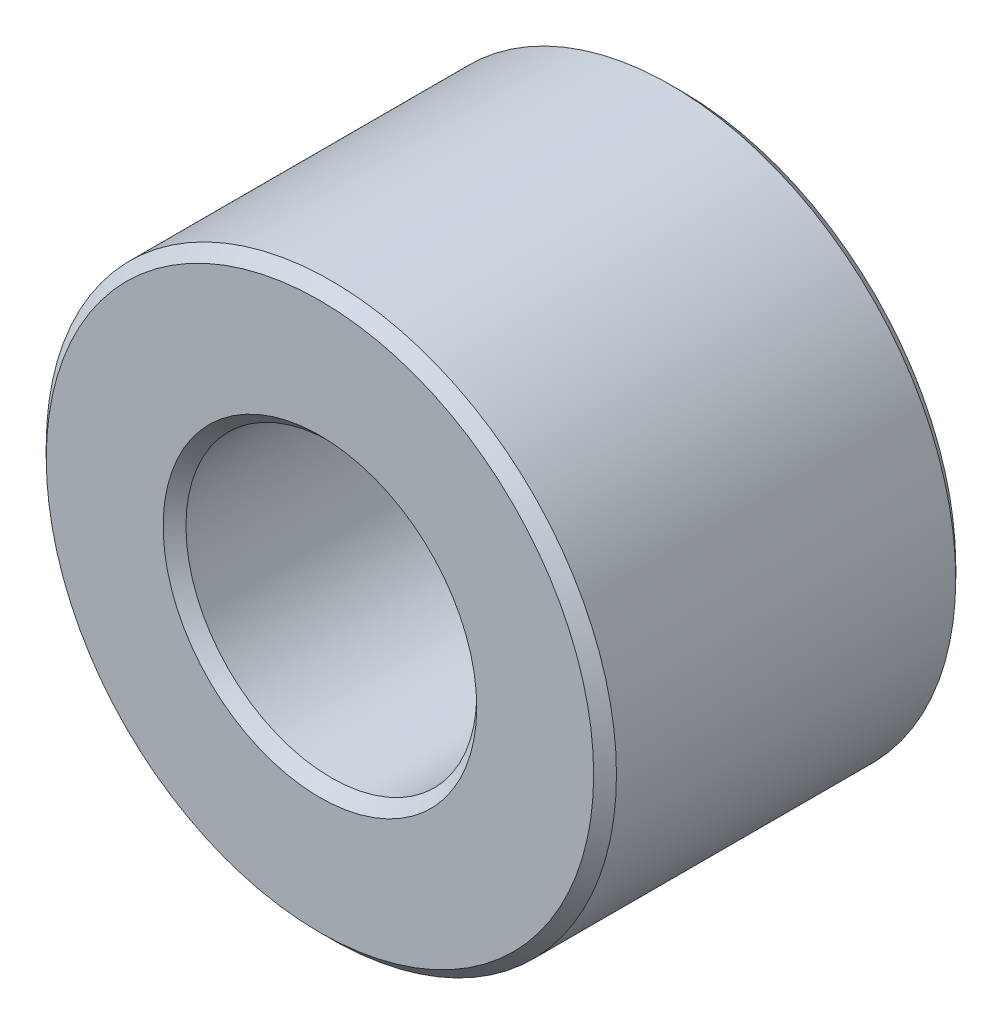
ISO-10303-21;
HEADER;
FILE_DESCRIPTION(('STEP AP214'),'2;1');
FILE_NAME('part.step','',(''),(''),'','','');
FILE_SCHEMA(('AUTOMOTIVE_DESIGN { 1 0 10303 214 1 1 1 1 }'));
ENDSEC;
DATA;
#1=APPLICATION_CONTEXT('core data for automotive mechanical design processes');
#2=APPLICATION_PROTOCOL_DEFINITION('international standard','automotive_design',2000,#1);
#3=PRODUCT_CONTEXT('',#1,'mechanical');
#4=PRODUCT('Part','Part','',(#3));
#5=PRODUCT_RELATED_PRODUCT_CATEGORY('part','',(#4));
#6=PRODUCT_DEFINITION_FORMATION('','',#4);
#7=PRODUCT_DEFINITION_CONTEXT('part definition',#1,'design');
#8=PRODUCT_DEFINITION('design','',#6,#7);
#9=PRODUCT_DEFINITION_SHAPE('','',#8);
#10=(LENGTH_UNIT() NAMED_UNIT(*) SI_UNIT(.MILLI.,.METRE.));
#11=(NAMED_UNIT(*) PLANE_ANGLE_UNIT() SI_UNIT($,.RADIAN.));
#12=(NAMED_UNIT(*) SI_UNIT($,.STERADIAN.) SOLID_ANGLE_UNIT());
#13=UNCERTAINTY_MEASURE_WITH_UNIT(LENGTH_MEASURE(1.E-05),#10,'distance_accuracy_value','');
#14=(GEOMETRIC_REPRESENTATION_CONTEXT(3) GLOBAL_UNCERTAINTY_ASSIGNED_CONTEXT((#13)) GLOBAL_UNIT_ASSIGNED_CONTEXT((#10,
#11,#12)) REPRESENTATION_CONTEXT('',''));
#15=CARTESIAN_POINT('',(0.,0.,0.));
#16=DIRECTION('',(0.,0.,1.));
#17=DIRECTION('',(1.,0.,0.));
#18=AXIS2_PLACEMENT_3D('',#15,#16,#17);
#19=CARTESIAN_POINT('',(0.,0.,6.35));
#20=DIRECTION('',(0.,0.,1.));
#21=DIRECTION('',(1.,0.,0.));
#22=AXIS2_PLACEMENT_3D('',#19,#20,#21);
#23=PLANE('',#22);
#24=CARTESIAN_POINT('',(0.,0.,6.35));
#25=DIRECTION('',(0.,0.,1.));
#26=DIRECTION('',(1.,0.,0.));
#27=AXIS2_PLACEMENT_3D('',#24,#25,#26);
#28=CIRCLE('',#27,2.75);
#29=CARTESIAN_POINT('',(2.75,0.,6.35));
#30=VERTEX_POINT('',#29);
#31=EDGE_CURVE('E10',#30,#30,#28,.F.);
#32=ORIENTED_EDGE('',*,*,#31,.T.);
#33=EDGE_LOOP('',(#32));
#34=FACE_BOUND('',#33,.T.);
#35=CARTESIAN_POINT('',(0.,0.,6.35));
#36=DIRECTION('',(0.,0.,1.));
#37=DIRECTION('',(1.,0.,0.));
#38=AXIS2_PLACEMENT_3D('',#35,#36,#37);
#39=CIRCLE('',#38,4.8);
#40=CARTESIAN_POINT('',(4.8,0.,6.35));
#41=VERTEX_POINT('',#40);
#42=EDGE_CURVE('E42',#41,#41,#39,.T.);
#43=ORIENTED_EDGE('',*,*,#42,.T.);
#44=EDGE_LOOP('',(#43));
#45=FACE_BOUND('',#44,.T.);
#46=ADVANCED_FACE('F34',(#34,#45),#23,.T.);
#47=CARTESIAN_POINT('',(0.,0.,0.));
#48=DIRECTION('',(0.,0.,1.));
#49=DIRECTION('',(1.,0.,0.));
#50=AXIS2_PLACEMENT_3D('',#47,#48,#49);
#51=PLANE('',#50);
#52=CARTESIAN_POINT('',(0.,0.,0.));
#53=DIRECTION('',(0.,0.,1.));
#54=DIRECTION('',(1.,0.,0.));
#55=AXIS2_PLACEMENT_3D('',#52,#53,#54);
#56=CIRCLE('',#55,4.8);
#57=CARTESIAN_POINT('',(4.8,0.,0.));
#58=VERTEX_POINT('',#57);
#59=EDGE_CURVE('E60',#58,#58,#56,.F.);
#60=ORIENTED_EDGE('',*,*,#59,.T.);
#61=EDGE_LOOP('',(#60));
#62=FACE_BOUND('',#61,.T.);
#63=CARTESIAN_POINT('',(0.,0.,0.));
#64=DIRECTION('',(0.,0.,1.));
#65=DIRECTION('',(1.,0.,0.));
#66=AXIS2_PLACEMENT_3D('',#63,#64,#65);
#67=CIRCLE('',#66,2.75);
#68=CARTESIAN_POINT('',(2.75,0.,0.));
#69=VERTEX_POINT('',#68);
#70=EDGE_CURVE('E63',#69,#69,#67,.T.);
#71=ORIENTED_EDGE('',*,*,#70,.T.);
#72=EDGE_LOOP('',(#71));
#73=FACE_BOUND('',#72,.T.);
#74=ADVANCED_FACE('F85',(#62,#73),#51,.F.);
#75=CARTESIAN_POINT('',(0.,0.,6.35));
#76=DIRECTION('',(0.,0.,-1.));
#77=DIRECTION('',(-1.,0.,0.));
#78=AXIS2_PLACEMENT_3D('',#75,#76,#77);
#79=CYLINDRICAL_SURFACE('',#78,5.);
#80=CARTESIAN_POINT('',(0.,0.,0.200000000000001));
#81=DIRECTION('',(0.,0.,1.));
#82=DIRECTION('',(1.,0.,0.));
#83=AXIS2_PLACEMENT_3D('',#80,#81,#82);
#84=CIRCLE('',#83,5.);
#85=CARTESIAN_POINT('',(5.,0.,0.200000000000001));
#86=VERTEX_POINT('',#85);
#87=EDGE_CURVE('E66',#86,#86,#84,.T.);
#88=ORIENTED_EDGE('',*,*,#87,.T.);
#89=EDGE_LOOP('',(#88));
#90=FACE_BOUND('',#89,.T.);
#91=CARTESIAN_POINT('',(0.,0.,6.15));
#92=DIRECTION('',(0.,0.,1.));
#93=DIRECTION('',(1.,0.,0.));
#94=AXIS2_PLACEMENT_3D('',#91,#92,#93);
#95=CIRCLE('',#94,5.);
#96=CARTESIAN_POINT('',(5.,0.,6.15));
#97=VERTEX_POINT('',#96);
#98=EDGE_CURVE('E69',#97,#97,#95,.F.);
#99=ORIENTED_EDGE('',*,*,#98,.T.);
#100=EDGE_LOOP('',(#99));
#101=FACE_BOUND('',#100,.T.);
#102=ADVANCED_FACE('F74',(#90,#101),#79,.T.);
#103=CARTESIAN_POINT('',(0.,0.,6.35));
#104=DIRECTION('',(0.,0.,-1.));
#105=DIRECTION('',(-1.,0.,0.));
#106=AXIS2_PLACEMENT_3D('',#103,#104,#105);
#107=CYLINDRICAL_SURFACE('',#106,2.55);
#108=CARTESIAN_POINT('',(0.,0.,0.200000000000001));
#109=DIRECTION('',(0.,0.,1.));
#110=DIRECTION('',(1.,0.,0.));
#111=AXIS2_PLACEMENT_3D('',#108,#109,#110);
#112=CIRCLE('',#111,2.55);
#113=CARTESIAN_POINT('',(2.55,0.,0.200000000000001));
#114=VERTEX_POINT('',#113);
#115=EDGE_CURVE('E50',#114,#114,#112,.F.);
#116=ORIENTED_EDGE('',*,*,#115,.T.);
#117=EDGE_LOOP('',(#116));
#118=FACE_BOUND('',#117,.T.);
#119=CARTESIAN_POINT('',(0.,0.,6.15));
#120=DIRECTION('',(0.,0.,1.));
#121=DIRECTION('',(1.,0.,0.));
#122=AXIS2_PLACEMENT_3D('',#119,#120,#121);
#123=CIRCLE('',#122,2.55);
#124=CARTESIAN_POINT('',(2.55,0.,6.15));
#125=VERTEX_POINT('',#124);
#126=EDGE_CURVE('E55',#125,#125,#123,.T.);
#127=ORIENTED_EDGE('',*,*,#126,.T.);
#128=EDGE_LOOP('',(#127));
#129=FACE_BOUND('',#128,.T.);
#130=ADVANCED_FACE('F93',(#118,#129),#107,.F.);
#131=CARTESIAN_POINT('',(0.,0.,0.200000000000001));
#132=DIRECTION('',(0.,0.,1.));
#133=DIRECTION('',(1.,0.,0.));
#134=AXIS2_PLACEMENT_3D('',#131,#132,#133);
#135=CONICAL_SURFACE('',#134,5.,0.785398163397448);
#136=ORIENTED_EDGE('',*,*,#59,.F.);
#137=EDGE_LOOP('',(#136));
#138=FACE_BOUND('',#137,.T.);
#139=ORIENTED_EDGE('',*,*,#87,.F.);
#140=EDGE_LOOP('',(#139));
#141=FACE_BOUND('',#140,.T.);
#142=ADVANCED_FACE('F98',(#138,#141),#135,.T.);
#143=CARTESIAN_POINT('',(0.,0.,0.));
#144=DIRECTION('',(0.,0.,-1.));
#145=DIRECTION('',(-1.,0.,0.));
#146=AXIS2_PLACEMENT_3D('',#143,#144,#145);
#147=CONICAL_SURFACE('',#146,2.75,0.785398163397447);
#148=ORIENTED_EDGE('',*,*,#115,.F.);
#149=EDGE_LOOP('',(#148));
#150=FACE_BOUND('',#149,.T.);
#151=ORIENTED_EDGE('',*,*,#70,.F.);
#152=EDGE_LOOP('',(#151));
#153=FACE_BOUND('',#152,.T.);
#154=ADVANCED_FACE('F82',(#150,#153),#147,.F.);
#155=CARTESIAN_POINT('',(0.,0.,6.15));
#156=DIRECTION('',(0.,0.,1.));
#157=DIRECTION('',(1.,0.,0.));
#158=AXIS2_PLACEMENT_3D('',#155,#156,#157);
#159=CONICAL_SURFACE('',#158,2.55,0.785398163397454);
#160=ORIENTED_EDGE('',*,*,#31,.F.);
#161=EDGE_LOOP('',(#160));
#162=FACE_BOUND('',#161,.T.);
#163=ORIENTED_EDGE('',*,*,#126,.F.);
#164=EDGE_LOOP('',(#163));
#165=FACE_BOUND('',#164,.T.);
#166=ADVANCED_FACE('F78',(#162,#165),#159,.F.);
#167=CARTESIAN_POINT('',(0.,0.,6.35));
#168=DIRECTION('',(0.,0.,-1.));
#169=DIRECTION('',(-1.,0.,0.));
#170=AXIS2_PLACEMENT_3D('',#167,#168,#169);
#171=CONICAL_SURFACE('',#170,4.8,0.785398163397444);
#172=ORIENTED_EDGE('',*,*,#98,.F.);
#173=EDGE_LOOP('',(#172));
#174=FACE_BOUND('',#173,.T.);
#175=ORIENTED_EDGE('',*,*,#42,.F.);
#176=EDGE_LOOP('',(#175));
#177=FACE_BOUND('',#176,.T.);
#178=ADVANCED_FACE('F36',(#174,#177),#171,.T.);
#179=CLOSED_SHELL('',(#46,#74,#102,#130,#142,#154,#166,#178));
#180=MANIFOLD_SOLID_BREP('B2',#179);
#181=ADVANCED_BREP_SHAPE_REPRESENTATION('',(#18,#180),#14);
#182=SHAPE_DEFINITION_REPRESENTATION(#9,#181);
ENDSEC;
END-ISO-10303-21;
